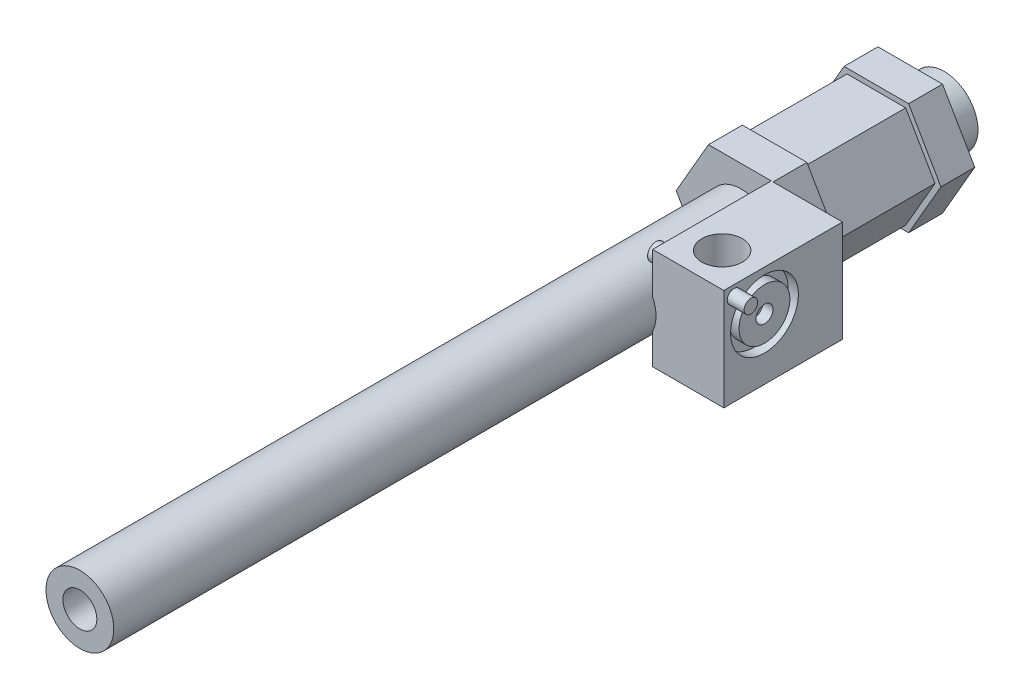
ISO-10303-21;
HEADER;
FILE_DESCRIPTION(('STEP AP214'),'2;1');
FILE_NAME('part.step','',(''),(''),'','','');
FILE_SCHEMA(('AUTOMOTIVE_DESIGN { 1 0 10303 214 1 1 1 1 }'));
ENDSEC;
DATA;
#1=APPLICATION_CONTEXT('core data for automotive mechanical design processes');
#2=APPLICATION_PROTOCOL_DEFINITION('international standard','automotive_design',2000,#1);
#3=PRODUCT_CONTEXT('',#1,'mechanical');
#4=PRODUCT('Part','Part','',(#3));
#5=PRODUCT_RELATED_PRODUCT_CATEGORY('part','',(#4));
#6=PRODUCT_DEFINITION_FORMATION('','',#4);
#7=PRODUCT_DEFINITION_CONTEXT('part definition',#1,'design');
#8=PRODUCT_DEFINITION('design','',#6,#7);
#9=PRODUCT_DEFINITION_SHAPE('','',#8);
#10=(LENGTH_UNIT() NAMED_UNIT(*) SI_UNIT(.MILLI.,.METRE.));
#11=(NAMED_UNIT(*) PLANE_ANGLE_UNIT() SI_UNIT($,.RADIAN.));
#12=(NAMED_UNIT(*) SI_UNIT($,.STERADIAN.) SOLID_ANGLE_UNIT());
#13=UNCERTAINTY_MEASURE_WITH_UNIT(LENGTH_MEASURE(1.E-05),#10,'distance_accuracy_value','');
#14=(GEOMETRIC_REPRESENTATION_CONTEXT(3) GLOBAL_UNCERTAINTY_ASSIGNED_CONTEXT((#13)) GLOBAL_UNIT_ASSIGNED_CONTEXT((#10,
#11,#12)) REPRESENTATION_CONTEXT('',''));
#15=CARTESIAN_POINT('',(0.,0.,0.));
#16=DIRECTION('',(0.,0.,1.));
#17=DIRECTION('',(1.,0.,0.));
#18=AXIS2_PLACEMENT_3D('',#15,#16,#17);
#19=CARTESIAN_POINT('',(0.,0.,60.));
#20=DIRECTION('',(0.,0.,-1.));
#21=DIRECTION('',(-1.,0.,0.));
#22=AXIS2_PLACEMENT_3D('',#19,#20,#21);
#23=PLANE('',#22);
#24=DIRECTION('',(1.,0.,0.));
#25=VECTOR('',#24,1.);
#26=CARTESIAN_POINT('',(9.,-13.5,60.));
#27=LINE('',#26,#25);
#28=CARTESIAN_POINT('',(9.,-13.5,60.));
#29=VERTEX_POINT('',#28);
#30=CARTESIAN_POINT('',(11.2583302491977,-13.5,60.));
#31=VERTEX_POINT('',#30);
#32=EDGE_CURVE('E217',#29,#31,#27,.T.);
#33=ORIENTED_EDGE('',*,*,#32,.F.);
#34=DIRECTION('',(0.,1.,0.));
#35=VECTOR('',#34,1.);
#36=CARTESIAN_POINT('',(9.,0.,60.));
#37=LINE('',#36,#35);
#38=CARTESIAN_POINT('',(9.,-4.35889894354067,60.));
#39=VERTEX_POINT('',#38);
#40=EDGE_CURVE('E418',#29,#39,#37,.T.);
#41=ORIENTED_EDGE('',*,*,#40,.T.);
#42=CARTESIAN_POINT('',(0.,0.,60.));
#43=DIRECTION('',(0.,0.,-1.));
#44=DIRECTION('',(-1.,0.,0.));
#45=AXIS2_PLACEMENT_3D('',#42,#43,#44);
#46=CIRCLE('',#45,10.);
#47=CARTESIAN_POINT('',(9.,4.35889894354067,60.));
#48=VERTEX_POINT('',#47);
#49=EDGE_CURVE('E413',#39,#48,#46,.T.);
#50=ORIENTED_EDGE('',*,*,#49,.T.);
#51=DIRECTION('',(0.,-1.,0.));
#52=VECTOR('',#51,1.);
#53=CARTESIAN_POINT('',(9.,16.5,60.));
#54=LINE('',#53,#52);
#55=CARTESIAN_POINT('',(9.,16.5,60.));
#56=VERTEX_POINT('',#55);
#57=EDGE_CURVE('E244',#56,#48,#54,.T.);
#58=ORIENTED_EDGE('',*,*,#57,.F.);
#59=DIRECTION('',(1.,0.,0.));
#60=VECTOR('',#59,1.);
#61=CARTESIAN_POINT('',(-9.52627944162882,16.5,60.));
#62=LINE('',#61,#60);
#63=CARTESIAN_POINT('',(-9.52627944162882,16.5,60.));
#64=VERTEX_POINT('',#63);
#65=EDGE_CURVE('E289',#64,#56,#62,.T.);
#66=ORIENTED_EDGE('',*,*,#65,.F.);
#67=DIRECTION('',(0.5,0.866025403784438,0.));
#68=VECTOR('',#67,1.);
#69=CARTESIAN_POINT('',(-19.0525588832576,0.,60.));
#70=LINE('',#69,#68);
#71=CARTESIAN_POINT('',(-19.0525588832576,0.,60.));
#72=VERTEX_POINT('',#71);
#73=EDGE_CURVE('E286',#72,#64,#70,.T.);
#74=ORIENTED_EDGE('',*,*,#73,.F.);
#75=DIRECTION('',(-0.5,0.866025403784439,0.));
#76=VECTOR('',#75,1.);
#77=CARTESIAN_POINT('',(-9.52627944162882,-16.5,60.));
#78=LINE('',#77,#76);
#79=CARTESIAN_POINT('',(-9.52627944162882,-16.5,60.));
#80=VERTEX_POINT('',#79);
#81=EDGE_CURVE('E283',#80,#72,#78,.T.);
#82=ORIENTED_EDGE('',*,*,#81,.F.);
#83=DIRECTION('',(-1.,0.,0.));
#84=VECTOR('',#83,1.);
#85=CARTESIAN_POINT('',(9.52627944162882,-16.5,60.));
#86=LINE('',#85,#84);
#87=CARTESIAN_POINT('',(9.52627944162882,-16.5,60.));
#88=VERTEX_POINT('',#87);
#89=EDGE_CURVE('E279',#88,#80,#86,.T.);
#90=ORIENTED_EDGE('',*,*,#89,.F.);
#91=DIRECTION('',(-0.5,-0.866025403784439,0.));
#92=VECTOR('',#91,1.);
#93=CARTESIAN_POINT('',(19.0525588832576,0.,60.));
#94=LINE('',#93,#92);
#95=EDGE_CURVE('E280',#31,#88,#94,.T.);
#96=ORIENTED_EDGE('',*,*,#95,.F.);
#97=EDGE_LOOP('',(#33,#41,#50,#58,#66,#74,#82,#90,#96));
#98=FACE_BOUND('',#97,.T.);
#99=ADVANCED_FACE('F42',(#98),#23,.F.);
#100=CARTESIAN_POINT('',(-8.66025403784439,-15.,60.));
#101=DIRECTION('',(-0.866025403784439,-0.5,0.));
#102=DIRECTION('',(0.5,-0.866025403784439,0.));
#103=AXIS2_PLACEMENT_3D('',#100,#101,#102);
#104=PLANE('',#103);
#105=DIRECTION('',(-0.5,0.866025403784439,0.));
#106=VECTOR('',#105,1.);
#107=CARTESIAN_POINT('',(-8.66025403784439,-15.,50.));
#108=LINE('',#107,#106);
#109=CARTESIAN_POINT('',(-8.66025403784439,-15.,50.));
#110=VERTEX_POINT('',#109);
#111=CARTESIAN_POINT('',(-17.3205080756888,0.,50.));
#112=VERTEX_POINT('',#111);
#113=EDGE_CURVE('E272',#110,#112,#108,.T.);
#114=ORIENTED_EDGE('',*,*,#113,.T.);
#115=DIRECTION('',(0.,0.,-1.));
#116=VECTOR('',#115,1.);
#117=CARTESIAN_POINT('',(-17.3205080756888,0.,60.));
#118=LINE('',#117,#116);
#119=CARTESIAN_POINT('',(-17.3205080756888,0.,20.));
#120=VERTEX_POINT('',#119);
#121=EDGE_CURVE('E391',#112,#120,#118,.T.);
#122=ORIENTED_EDGE('',*,*,#121,.T.);
#123=DIRECTION('',(-0.5,0.866025403784439,0.));
#124=VECTOR('',#123,1.);
#125=CARTESIAN_POINT('',(-8.66025403784439,-15.,20.));
#126=LINE('',#125,#124);
#127=CARTESIAN_POINT('',(-8.66025403784439,-15.,20.));
#128=VERTEX_POINT('',#127);
#129=EDGE_CURVE('E337',#128,#120,#126,.T.);
#130=ORIENTED_EDGE('',*,*,#129,.F.);
#131=DIRECTION('',(0.,0.,-1.));
#132=VECTOR('',#131,1.);
#133=CARTESIAN_POINT('',(-8.66025403784439,-15.,60.));
#134=LINE('',#133,#132);
#135=EDGE_CURVE('E392',#110,#128,#134,.T.);
#136=ORIENTED_EDGE('',*,*,#135,.F.);
#137=EDGE_LOOP('',(#114,#122,#130,#136));
#138=FACE_BOUND('',#137,.T.);
#139=ADVANCED_FACE('F476',(#138),#104,.T.);
#140=CARTESIAN_POINT('',(8.66025403784439,-15.,60.));
#141=DIRECTION('',(0.,-1.,0.));
#142=DIRECTION('',(0.,0.,-1.));
#143=AXIS2_PLACEMENT_3D('',#140,#141,#142);
#144=PLANE('',#143);
#145=DIRECTION('',(-1.,0.,0.));
#146=VECTOR('',#145,1.);
#147=CARTESIAN_POINT('',(8.66025403784439,-15.,50.));
#148=LINE('',#147,#146);
#149=CARTESIAN_POINT('',(8.66025403784439,-15.,50.));
#150=VERTEX_POINT('',#149);
#151=EDGE_CURVE('E65',#150,#110,#148,.T.);
#152=ORIENTED_EDGE('',*,*,#151,.T.);
#153=ORIENTED_EDGE('',*,*,#135,.T.);
#154=DIRECTION('',(-1.,0.,0.));
#155=VECTOR('',#154,1.);
#156=CARTESIAN_POINT('',(8.66025403784439,-15.,20.));
#157=LINE('',#156,#155);
#158=CARTESIAN_POINT('',(8.66025403784439,-15.,20.));
#159=VERTEX_POINT('',#158);
#160=EDGE_CURVE('E334',#159,#128,#157,.T.);
#161=ORIENTED_EDGE('',*,*,#160,.F.);
#162=DIRECTION('',(0.,0.,-1.));
#163=VECTOR('',#162,1.);
#164=CARTESIAN_POINT('',(8.66025403784439,-15.,60.));
#165=LINE('',#164,#163);
#166=EDGE_CURVE('E395',#150,#159,#165,.T.);
#167=ORIENTED_EDGE('',*,*,#166,.F.);
#168=EDGE_LOOP('',(#152,#153,#161,#167));
#169=FACE_BOUND('',#168,.T.);
#170=ADVANCED_FACE('F481',(#169),#144,.T.);
#171=CARTESIAN_POINT('',(17.3205080756888,0.,60.));
#172=DIRECTION('',(0.866025403784439,-0.5,0.));
#173=DIRECTION('',(0.5,0.866025403784439,0.));
#174=AXIS2_PLACEMENT_3D('',#171,#172,#173);
#175=PLANE('',#174);
#176=DIRECTION('',(-0.5,-0.866025403784439,0.));
#177=VECTOR('',#176,1.);
#178=CARTESIAN_POINT('',(17.3205080756888,0.,50.));
#179=LINE('',#178,#177);
#180=CARTESIAN_POINT('',(17.3205080756888,0.,50.));
#181=VERTEX_POINT('',#180);
#182=EDGE_CURVE('E269',#181,#150,#179,.T.);
#183=ORIENTED_EDGE('',*,*,#182,.T.);
#184=ORIENTED_EDGE('',*,*,#166,.T.);
#185=DIRECTION('',(-0.5,-0.866025403784439,0.));
#186=VECTOR('',#185,1.);
#187=CARTESIAN_POINT('',(17.3205080756888,0.,20.));
#188=LINE('',#187,#186);
#189=CARTESIAN_POINT('',(17.3205080756888,0.,20.));
#190=VERTEX_POINT('',#189);
#191=EDGE_CURVE('E331',#190,#159,#188,.T.);
#192=ORIENTED_EDGE('',*,*,#191,.F.);
#193=DIRECTION('',(0.,0.,-1.));
#194=VECTOR('',#193,1.);
#195=CARTESIAN_POINT('',(17.3205080756888,0.,60.));
#196=LINE('',#195,#194);
#197=EDGE_CURVE('E397',#181,#190,#196,.T.);
#198=ORIENTED_EDGE('',*,*,#197,.F.);
#199=EDGE_LOOP('',(#183,#184,#192,#198));
#200=FACE_BOUND('',#199,.T.);
#201=ADVANCED_FACE('F494',(#200),#175,.T.);
#202=CARTESIAN_POINT('',(8.6602540378444,15.,60.));
#203=DIRECTION('',(0.866025403784439,0.5,0.));
#204=DIRECTION('',(-0.5,0.866025403784439,0.));
#205=AXIS2_PLACEMENT_3D('',#202,#203,#204);
#206=PLANE('',#205);
#207=DIRECTION('',(0.5,-0.866025403784439,0.));
#208=VECTOR('',#207,1.);
#209=CARTESIAN_POINT('',(8.6602540378444,15.,50.));
#210=LINE('',#209,#208);
#211=CARTESIAN_POINT('',(8.6602540378444,15.,50.));
#212=VERTEX_POINT('',#211);
#213=EDGE_CURVE('E267',#212,#181,#210,.T.);
#214=ORIENTED_EDGE('',*,*,#213,.T.);
#215=ORIENTED_EDGE('',*,*,#197,.T.);
#216=DIRECTION('',(0.5,-0.866025403784439,0.));
#217=VECTOR('',#216,1.);
#218=CARTESIAN_POINT('',(8.6602540378444,15.,20.));
#219=LINE('',#218,#217);
#220=CARTESIAN_POINT('',(8.6602540378444,15.,20.));
#221=VERTEX_POINT('',#220);
#222=EDGE_CURVE('E328',#221,#190,#219,.T.);
#223=ORIENTED_EDGE('',*,*,#222,.F.);
#224=DIRECTION('',(0.,0.,-1.));
#225=VECTOR('',#224,1.);
#226=CARTESIAN_POINT('',(8.6602540378444,15.,60.));
#227=LINE('',#226,#225);
#228=EDGE_CURVE('E399',#212,#221,#227,.T.);
#229=ORIENTED_EDGE('',*,*,#228,.F.);
#230=EDGE_LOOP('',(#214,#215,#223,#229));
#231=FACE_BOUND('',#230,.T.);
#232=ADVANCED_FACE('F497',(#231),#206,.T.);
#233=CARTESIAN_POINT('',(-8.66025403784437,15.,60.));
#234=DIRECTION('',(0.,1.,0.));
#235=DIRECTION('',(-1.,0.,0.));
#236=AXIS2_PLACEMENT_3D('',#233,#234,#235);
#237=PLANE('',#236);
#238=DIRECTION('',(1.,0.,0.));
#239=VECTOR('',#238,1.);
#240=CARTESIAN_POINT('',(-8.66025403784437,15.,50.));
#241=LINE('',#240,#239);
#242=CARTESIAN_POINT('',(-8.66025403784437,15.,50.));
#243=VERTEX_POINT('',#242);
#244=EDGE_CURVE('E265',#243,#212,#241,.T.);
#245=ORIENTED_EDGE('',*,*,#244,.T.);
#246=ORIENTED_EDGE('',*,*,#228,.T.);
#247=DIRECTION('',(1.,0.,0.));
#248=VECTOR('',#247,1.);
#249=CARTESIAN_POINT('',(-8.66025403784437,15.,20.));
#250=LINE('',#249,#248);
#251=CARTESIAN_POINT('',(-8.66025403784437,15.,20.));
#252=VERTEX_POINT('',#251);
#253=EDGE_CURVE('E325',#252,#221,#250,.T.);
#254=ORIENTED_EDGE('',*,*,#253,.F.);
#255=DIRECTION('',(0.,0.,-1.));
#256=VECTOR('',#255,1.);
#257=CARTESIAN_POINT('',(-8.66025403784437,15.,60.));
#258=LINE('',#257,#256);
#259=EDGE_CURVE('E401',#243,#252,#258,.T.);
#260=ORIENTED_EDGE('',*,*,#259,.F.);
#261=EDGE_LOOP('',(#245,#246,#254,#260));
#262=FACE_BOUND('',#261,.T.);
#263=ADVANCED_FACE('F501',(#262),#237,.T.);
#264=CARTESIAN_POINT('',(-17.3205080756888,0.,60.));
#265=DIRECTION('',(-0.866025403784439,0.5,0.));
#266=DIRECTION('',(-0.5,-0.866025403784439,0.));
#267=AXIS2_PLACEMENT_3D('',#264,#265,#266);
#268=PLANE('',#267);
#269=DIRECTION('',(0.5,0.866025403784439,0.));
#270=VECTOR('',#269,1.);
#271=CARTESIAN_POINT('',(-17.3205080756888,0.,50.));
#272=LINE('',#271,#270);
#273=EDGE_CURVE('E263',#112,#243,#272,.T.);
#274=ORIENTED_EDGE('',*,*,#273,.T.);
#275=ORIENTED_EDGE('',*,*,#259,.T.);
#276=DIRECTION('',(0.5,0.866025403784439,0.));
#277=VECTOR('',#276,1.);
#278=CARTESIAN_POINT('',(-17.3205080756888,0.,20.));
#279=LINE('',#278,#277);
#280=EDGE_CURVE('E313',#120,#252,#279,.T.);
#281=ORIENTED_EDGE('',*,*,#280,.F.);
#282=ORIENTED_EDGE('',*,*,#121,.F.);
#283=EDGE_LOOP('',(#274,#275,#281,#282));
#284=FACE_BOUND('',#283,.T.);
#285=ADVANCED_FACE('F505',(#284),#268,.T.);
#286=CARTESIAN_POINT('',(19.0525588832576,0.,20.));
#287=DIRECTION('',(0.866025403784439,-0.5,0.));
#288=DIRECTION('',(0.5,0.866025403784439,0.));
#289=AXIS2_PLACEMENT_3D('',#286,#287,#288);
#290=PLANE('',#289);
#291=DIRECTION('',(-0.5,-0.866025403784439,0.));
#292=VECTOR('',#291,1.);
#293=CARTESIAN_POINT('',(19.0525588832576,0.,10.));
#294=LINE('',#293,#292);
#295=CARTESIAN_POINT('',(19.0525588832576,0.,10.));
#296=VERTEX_POINT('',#295);
#297=CARTESIAN_POINT('',(9.52627944162882,-16.5,10.));
#298=VERTEX_POINT('',#297);
#299=EDGE_CURVE('E340',#296,#298,#294,.T.);
#300=ORIENTED_EDGE('',*,*,#299,.F.);
#301=DIRECTION('',(0.,0.,-1.));
#302=VECTOR('',#301,1.);
#303=CARTESIAN_POINT('',(19.0525588832576,0.,20.));
#304=LINE('',#303,#302);
#305=CARTESIAN_POINT('',(19.0525588832576,0.,20.));
#306=VERTEX_POINT('',#305);
#307=EDGE_CURVE('E377',#306,#296,#304,.T.);
#308=ORIENTED_EDGE('',*,*,#307,.F.);
#309=DIRECTION('',(-0.5,-0.866025403784439,0.));
#310=VECTOR('',#309,1.);
#311=CARTESIAN_POINT('',(19.0525588832576,0.,20.));
#312=LINE('',#311,#310);
#313=CARTESIAN_POINT('',(9.52627944162882,-16.5,20.));
#314=VERTEX_POINT('',#313);
#315=EDGE_CURVE('E341',#306,#314,#312,.T.);
#316=ORIENTED_EDGE('',*,*,#315,.T.);
#317=DIRECTION('',(0.,0.,-1.));
#318=VECTOR('',#317,1.);
#319=CARTESIAN_POINT('',(9.52627944162882,-16.5,20.));
#320=LINE('',#319,#318);
#321=EDGE_CURVE('E360',#314,#298,#320,.T.);
#322=ORIENTED_EDGE('',*,*,#321,.T.);
#323=EDGE_LOOP('',(#300,#308,#316,#322));
#324=FACE_BOUND('',#323,.T.);
#325=ADVANCED_FACE('F486',(#324),#290,.T.);
#326=CARTESIAN_POINT('',(9.52627944162883,16.5,20.));
#327=DIRECTION('',(0.866025403784439,0.499999999999999,0.));
#328=DIRECTION('',(-0.5,0.866025403784439,0.));
#329=AXIS2_PLACEMENT_3D('',#326,#327,#328);
#330=PLANE('',#329);
#331=DIRECTION('',(0.499999999999999,-0.866025403784439,0.));
#332=VECTOR('',#331,1.);
#333=CARTESIAN_POINT('',(9.52627944162883,16.5,10.));
#334=LINE('',#333,#332);
#335=CARTESIAN_POINT('',(9.52627944162883,16.5,10.));
#336=VERTEX_POINT('',#335);
#337=EDGE_CURVE('E345',#336,#296,#334,.T.);
#338=ORIENTED_EDGE('',*,*,#337,.F.);
#339=DIRECTION('',(0.,0.,-1.));
#340=VECTOR('',#339,1.);
#341=CARTESIAN_POINT('',(9.52627944162883,16.5,20.));
#342=LINE('',#341,#340);
#343=CARTESIAN_POINT('',(9.52627944162883,16.5,20.));
#344=VERTEX_POINT('',#343);
#345=EDGE_CURVE('E380',#344,#336,#342,.T.);
#346=ORIENTED_EDGE('',*,*,#345,.F.);
#347=DIRECTION('',(0.499999999999999,-0.866025403784439,0.));
#348=VECTOR('',#347,1.);
#349=CARTESIAN_POINT('',(9.52627944162883,16.5,20.));
#350=LINE('',#349,#348);
#351=EDGE_CURVE('E357',#344,#306,#350,.T.);
#352=ORIENTED_EDGE('',*,*,#351,.T.);
#353=ORIENTED_EDGE('',*,*,#307,.T.);
#354=EDGE_LOOP('',(#338,#346,#352,#353));
#355=FACE_BOUND('',#354,.T.);
#356=ADVANCED_FACE('F538',(#355),#330,.T.);
#357=CARTESIAN_POINT('',(-9.52627944162882,16.5,20.));
#358=DIRECTION('',(0.,1.,0.));
#359=DIRECTION('',(-1.,0.,0.));
#360=AXIS2_PLACEMENT_3D('',#357,#358,#359);
#361=PLANE('',#360);
#362=DIRECTION('',(1.,0.,0.));
#363=VECTOR('',#362,1.);
#364=CARTESIAN_POINT('',(-9.52627944162882,16.5,10.));
#365=LINE('',#364,#363);
#366=CARTESIAN_POINT('',(-9.52627944162882,16.5,10.));
#367=VERTEX_POINT('',#366);
#368=EDGE_CURVE('E372',#367,#336,#365,.T.);
#369=ORIENTED_EDGE('',*,*,#368,.F.);
#370=DIRECTION('',(0.,0.,-1.));
#371=VECTOR('',#370,1.);
#372=CARTESIAN_POINT('',(-9.52627944162882,16.5,20.));
#373=LINE('',#372,#371);
#374=CARTESIAN_POINT('',(-9.52627944162882,16.5,20.));
#375=VERTEX_POINT('',#374);
#376=EDGE_CURVE('E382',#375,#367,#373,.T.);
#377=ORIENTED_EDGE('',*,*,#376,.F.);
#378=DIRECTION('',(1.,0.,0.));
#379=VECTOR('',#378,1.);
#380=CARTESIAN_POINT('',(-9.52627944162882,16.5,20.));
#381=LINE('',#380,#379);
#382=EDGE_CURVE('E354',#375,#344,#381,.T.);
#383=ORIENTED_EDGE('',*,*,#382,.T.);
#384=ORIENTED_EDGE('',*,*,#345,.T.);
#385=EDGE_LOOP('',(#369,#377,#383,#384));
#386=FACE_BOUND('',#385,.T.);
#387=ADVANCED_FACE('F541',(#386),#361,.T.);
#388=CARTESIAN_POINT('',(-19.0525588832576,0.,20.));
#389=DIRECTION('',(-0.866025403784439,0.5,0.));
#390=DIRECTION('',(-0.5,-0.866025403784439,0.));
#391=AXIS2_PLACEMENT_3D('',#388,#389,#390);
#392=PLANE('',#391);
#393=DIRECTION('',(0.5,0.866025403784438,0.));
#394=VECTOR('',#393,1.);
#395=CARTESIAN_POINT('',(-19.0525588832576,0.,10.));
#396=LINE('',#395,#394);
#397=CARTESIAN_POINT('',(-19.0525588832576,0.,10.));
#398=VERTEX_POINT('',#397);
#399=EDGE_CURVE('E369',#398,#367,#396,.T.);
#400=ORIENTED_EDGE('',*,*,#399,.F.);
#401=DIRECTION('',(0.,0.,-1.));
#402=VECTOR('',#401,1.);
#403=CARTESIAN_POINT('',(-19.0525588832576,0.,20.));
#404=LINE('',#403,#402);
#405=CARTESIAN_POINT('',(-19.0525588832576,0.,20.));
#406=VERTEX_POINT('',#405);
#407=EDGE_CURVE('E384',#406,#398,#404,.T.);
#408=ORIENTED_EDGE('',*,*,#407,.F.);
#409=DIRECTION('',(0.5,0.866025403784438,0.));
#410=VECTOR('',#409,1.);
#411=CARTESIAN_POINT('',(-19.0525588832576,0.,20.));
#412=LINE('',#411,#410);
#413=EDGE_CURVE('E351',#406,#375,#412,.T.);
#414=ORIENTED_EDGE('',*,*,#413,.T.);
#415=ORIENTED_EDGE('',*,*,#376,.T.);
#416=EDGE_LOOP('',(#400,#408,#414,#415));
#417=FACE_BOUND('',#416,.T.);
#418=ADVANCED_FACE('F545',(#417),#392,.T.);
#419=CARTESIAN_POINT('',(-9.52627944162882,-16.5,20.));
#420=DIRECTION('',(-0.866025403784439,-0.5,0.));
#421=DIRECTION('',(0.5,-0.866025403784439,0.));
#422=AXIS2_PLACEMENT_3D('',#419,#420,#421);
#423=PLANE('',#422);
#424=DIRECTION('',(-0.5,0.866025403784439,0.));
#425=VECTOR('',#424,1.);
#426=CARTESIAN_POINT('',(-9.52627944162882,-16.5,10.));
#427=LINE('',#426,#425);
#428=CARTESIAN_POINT('',(-9.52627944162882,-16.5,10.));
#429=VERTEX_POINT('',#428);
#430=EDGE_CURVE('E366',#429,#398,#427,.T.);
#431=ORIENTED_EDGE('',*,*,#430,.F.);
#432=DIRECTION('',(0.,0.,-1.));
#433=VECTOR('',#432,1.);
#434=CARTESIAN_POINT('',(-9.52627944162882,-16.5,20.));
#435=LINE('',#434,#433);
#436=CARTESIAN_POINT('',(-9.52627944162882,-16.5,20.));
#437=VERTEX_POINT('',#436);
#438=EDGE_CURVE('E386',#437,#429,#435,.T.);
#439=ORIENTED_EDGE('',*,*,#438,.F.);
#440=DIRECTION('',(-0.5,0.866025403784439,0.));
#441=VECTOR('',#440,1.);
#442=CARTESIAN_POINT('',(-9.52627944162882,-16.5,20.));
#443=LINE('',#442,#441);
#444=EDGE_CURVE('E348',#437,#406,#443,.T.);
#445=ORIENTED_EDGE('',*,*,#444,.T.);
#446=ORIENTED_EDGE('',*,*,#407,.T.);
#447=EDGE_LOOP('',(#431,#439,#445,#446));
#448=FACE_BOUND('',#447,.T.);
#449=ADVANCED_FACE('F533',(#448),#423,.T.);
#450=CARTESIAN_POINT('',(9.52627944162882,-16.5,20.));
#451=DIRECTION('',(0.,-1.,0.));
#452=DIRECTION('',(0.,0.,-1.));
#453=AXIS2_PLACEMENT_3D('',#450,#451,#452);
#454=PLANE('',#453);
#455=DIRECTION('',(-1.,0.,0.));
#456=VECTOR('',#455,1.);
#457=CARTESIAN_POINT('',(9.52627944162882,-16.5,10.));
#458=LINE('',#457,#456);
#459=EDGE_CURVE('E363',#298,#429,#458,.T.);
#460=ORIENTED_EDGE('',*,*,#459,.F.);
#461=ORIENTED_EDGE('',*,*,#321,.F.);
#462=DIRECTION('',(-1.,0.,0.));
#463=VECTOR('',#462,1.);
#464=CARTESIAN_POINT('',(9.52627944162882,-16.5,20.));
#465=LINE('',#464,#463);
#466=EDGE_CURVE('E344',#314,#437,#465,.T.);
#467=ORIENTED_EDGE('',*,*,#466,.T.);
#468=ORIENTED_EDGE('',*,*,#438,.T.);
#469=EDGE_LOOP('',(#460,#461,#467,#468));
#470=FACE_BOUND('',#469,.T.);
#471=ADVANCED_FACE('F525',(#470),#454,.T.);
#472=CARTESIAN_POINT('',(0.,0.,20.));
#473=DIRECTION('',(0.,0.,-1.));
#474=DIRECTION('',(-1.,0.,0.));
#475=AXIS2_PLACEMENT_3D('',#472,#473,#474);
#476=PLANE('',#475);
#477=ORIENTED_EDGE('',*,*,#129,.T.);
#478=ORIENTED_EDGE('',*,*,#280,.T.);
#479=ORIENTED_EDGE('',*,*,#253,.T.);
#480=ORIENTED_EDGE('',*,*,#222,.T.);
#481=ORIENTED_EDGE('',*,*,#191,.T.);
#482=ORIENTED_EDGE('',*,*,#160,.T.);
#483=EDGE_LOOP('',(#477,#478,#479,#480,#481,#482));
#484=FACE_BOUND('',#483,.T.);
#485=ORIENTED_EDGE('',*,*,#315,.F.);
#486=ORIENTED_EDGE('',*,*,#351,.F.);
#487=ORIENTED_EDGE('',*,*,#382,.F.);
#488=ORIENTED_EDGE('',*,*,#413,.F.);
#489=ORIENTED_EDGE('',*,*,#444,.F.);
#490=ORIENTED_EDGE('',*,*,#466,.F.);
#491=EDGE_LOOP('',(#485,#486,#487,#488,#489,#490));
#492=FACE_BOUND('',#491,.T.);
#493=ADVANCED_FACE('F518',(#484,#492),#476,.F.);
#494=CARTESIAN_POINT('',(0.,0.,0.));
#495=DIRECTION('',(0.,0.,1.));
#496=DIRECTION('',(1.,0.,0.));
#497=AXIS2_PLACEMENT_3D('',#494,#495,#496);
#498=PLANE('',#497);
#499=CARTESIAN_POINT('',(0.,0.,0.));
#500=DIRECTION('',(0.,0.,1.));
#501=DIRECTION('',(1.,0.,0.));
#502=AXIS2_PLACEMENT_3D('',#499,#500,#501);
#503=CIRCLE('',#502,10.);
#504=CARTESIAN_POINT('',(10.,0.,0.));
#505=VERTEX_POINT('',#504);
#506=EDGE_CURVE('E407',#505,#505,#503,.T.);
#507=ORIENTED_EDGE('',*,*,#506,.F.);
#508=EDGE_LOOP('',(#507));
#509=FACE_BOUND('',#508,.T.);
#510=ADVANCED_FACE('F516',(#509),#498,.F.);
#511=CARTESIAN_POINT('',(0.,0.,255.));
#512=DIRECTION('',(0.,0.,-1.));
#513=DIRECTION('',(-1.,0.,0.));
#514=AXIS2_PLACEMENT_3D('',#511,#512,#513);
#515=CYLINDRICAL_SURFACE('',#514,10.);
#516=CARTESIAN_POINT('',(0.,0.,10.));
#517=DIRECTION('',(0.,0.,-1.));
#518=DIRECTION('',(-1.,0.,0.));
#519=AXIS2_PLACEMENT_3D('',#516,#517,#518);
#520=CIRCLE('',#519,10.);
#521=CARTESIAN_POINT('',(-10.,0.,10.));
#522=VERTEX_POINT('',#521);
#523=EDGE_CURVE('E379',#522,#522,#520,.T.);
#524=ORIENTED_EDGE('',*,*,#523,.T.);
#525=EDGE_LOOP('',(#524));
#526=FACE_BOUND('',#525,.T.);
#527=ORIENTED_EDGE('',*,*,#506,.T.);
#528=EDGE_LOOP('',(#527));
#529=FACE_BOUND('',#528,.T.);
#530=ADVANCED_FACE('F44',(#526,#529),#515,.T.);
#531=CARTESIAN_POINT('',(0.,0.,10.));
#532=DIRECTION('',(0.,0.,-1.));
#533=DIRECTION('',(-1.,0.,0.));
#534=AXIS2_PLACEMENT_3D('',#531,#532,#533);
#535=PLANE('',#534);
#536=ORIENTED_EDGE('',*,*,#523,.F.);
#537=EDGE_LOOP('',(#536));
#538=FACE_BOUND('',#537,.T.);
#539=ORIENTED_EDGE('',*,*,#299,.T.);
#540=ORIENTED_EDGE('',*,*,#459,.T.);
#541=ORIENTED_EDGE('',*,*,#430,.T.);
#542=ORIENTED_EDGE('',*,*,#399,.T.);
#543=ORIENTED_EDGE('',*,*,#368,.T.);
#544=ORIENTED_EDGE('',*,*,#337,.T.);
#545=EDGE_LOOP('',(#539,#540,#541,#542,#543,#544));
#546=FACE_BOUND('',#545,.T.);
#547=ADVANCED_FACE('F488',(#538,#546),#535,.T.);
#548=CARTESIAN_POINT('',(19.0525588832576,0.,60.));
#549=DIRECTION('',(0.866025403784439,-0.5,0.));
#550=DIRECTION('',(0.5,0.866025403784439,0.));
#551=AXIS2_PLACEMENT_3D('',#548,#549,#550);
#552=PLANE('',#551);
#553=DIRECTION('',(-0.5,-0.866025403784439,0.));
#554=VECTOR('',#553,1.);
#555=CARTESIAN_POINT('',(19.0525588832576,0.,50.));
#556=LINE('',#555,#554);
#557=CARTESIAN_POINT('',(19.0525588832576,0.,50.));
#558=VERTEX_POINT('',#557);
#559=CARTESIAN_POINT('',(9.52627944162882,-16.5,50.));
#560=VERTEX_POINT('',#559);
#561=EDGE_CURVE('E275',#558,#560,#556,.T.);
#562=ORIENTED_EDGE('',*,*,#561,.F.);
#563=DIRECTION('',(0.,0.,-1.));
#564=VECTOR('',#563,1.);
#565=CARTESIAN_POINT('',(19.0525588832576,0.,60.));
#566=LINE('',#565,#564);
#567=CARTESIAN_POINT('',(19.0525588832576,0.,60.));
#568=VERTEX_POINT('',#567);
#569=EDGE_CURVE('E311',#568,#558,#566,.T.);
#570=ORIENTED_EDGE('',*,*,#569,.F.);
#571=EDGE_CURVE('E276',#568,#31,#94,.T.);
#572=ORIENTED_EDGE('',*,*,#571,.T.);
#573=ORIENTED_EDGE('',*,*,#95,.T.);
#574=DIRECTION('',(0.,0.,-1.));
#575=VECTOR('',#574,1.);
#576=CARTESIAN_POINT('',(9.52627944162882,-16.5,60.));
#577=LINE('',#576,#575);
#578=EDGE_CURVE('E293',#88,#560,#577,.T.);
#579=ORIENTED_EDGE('',*,*,#578,.T.);
#580=EDGE_LOOP('',(#562,#570,#572,#573,#579));
#581=FACE_BOUND('',#580,.T.);
#582=ADVANCED_FACE('F453',(#581),#552,.T.);
#583=CARTESIAN_POINT('',(9.52627944162883,16.5,60.));
#584=DIRECTION('',(0.866025403784439,0.499999999999999,0.));
#585=DIRECTION('',(-0.5,0.866025403784439,0.));
#586=AXIS2_PLACEMENT_3D('',#583,#584,#585);
#587=PLANE('',#586);
#588=DIRECTION('',(0.499999999999999,-0.866025403784439,0.));
#589=VECTOR('',#588,1.);
#590=CARTESIAN_POINT('',(9.52627944162883,16.5,50.));
#591=LINE('',#590,#589);
#592=CARTESIAN_POINT('',(9.52627944162883,16.5,50.));
#593=VERTEX_POINT('',#592);
#594=EDGE_CURVE('E308',#593,#558,#591,.T.);
#595=ORIENTED_EDGE('',*,*,#594,.F.);
#596=DIRECTION('',(0.,0.,-1.));
#597=VECTOR('',#596,1.);
#598=CARTESIAN_POINT('',(9.52627944162883,16.5,60.));
#599=LINE('',#598,#597);
#600=CARTESIAN_POINT('',(9.52627944162883,16.5,60.));
#601=VERTEX_POINT('',#600);
#602=EDGE_CURVE('E314',#601,#593,#599,.T.);
#603=ORIENTED_EDGE('',*,*,#602,.F.);
#604=DIRECTION('',(0.499999999999999,-0.866025403784439,0.));
#605=VECTOR('',#604,1.);
#606=CARTESIAN_POINT('',(9.52627944162883,16.5,60.));
#607=LINE('',#606,#605);
#608=EDGE_CURVE('E213',#601,#568,#607,.T.);
#609=ORIENTED_EDGE('',*,*,#608,.T.);
#610=ORIENTED_EDGE('',*,*,#569,.T.);
#611=EDGE_LOOP('',(#595,#603,#609,#610));
#612=FACE_BOUND('',#611,.T.);
#613=ADVANCED_FACE('F457',(#612),#587,.T.);
#614=CARTESIAN_POINT('',(-9.52627944162882,16.5,60.));
#615=DIRECTION('',(0.,1.,0.));
#616=DIRECTION('',(-1.,0.,0.));
#617=AXIS2_PLACEMENT_3D('',#614,#615,#616);
#618=PLANE('',#617);
#619=CARTESIAN_POINT('',(19.5,16.5,85.));
#620=DIRECTION('',(0.,1.,0.));
#621=DIRECTION('',(0.,0.,1.));
#622=AXIS2_PLACEMENT_3D('',#619,#620,#621);
#623=CIRCLE('',#622,6.);
#624=CARTESIAN_POINT('',(19.5,16.5,91.));
#625=VERTEX_POINT('',#624);
#626=EDGE_CURVE('E237',#625,#625,#623,.T.);
#627=ORIENTED_EDGE('',*,*,#626,.F.);
#628=EDGE_LOOP('',(#627));
#629=FACE_BOUND('',#628,.T.);
#630=DIRECTION('',(1.,0.,0.));
#631=VECTOR('',#630,1.);
#632=CARTESIAN_POINT('',(-9.52627944162882,16.5,50.));
#633=LINE('',#632,#631);
#634=CARTESIAN_POINT('',(-9.52627944162882,16.5,50.));
#635=VERTEX_POINT('',#634);
#636=EDGE_CURVE('E305',#635,#593,#633,.T.);
#637=ORIENTED_EDGE('',*,*,#636,.F.);
#638=DIRECTION('',(0.,0.,-1.));
#639=VECTOR('',#638,1.);
#640=CARTESIAN_POINT('',(-9.52627944162882,16.5,60.));
#641=LINE('',#640,#639);
#642=EDGE_CURVE('E316',#64,#635,#641,.T.);
#643=ORIENTED_EDGE('',*,*,#642,.F.);
#644=ORIENTED_EDGE('',*,*,#65,.T.);
#645=DIRECTION('',(0.,0.,-1.));
#646=VECTOR('',#645,1.);
#647=CARTESIAN_POINT('',(9.,16.5,95.));
#648=LINE('',#647,#646);
#649=CARTESIAN_POINT('',(9.,16.5,95.));
#650=VERTEX_POINT('',#649);
#651=EDGE_CURVE('E57',#650,#56,#648,.T.);
#652=ORIENTED_EDGE('',*,*,#651,.F.);
#653=DIRECTION('',(1.,0.,0.));
#654=VECTOR('',#653,1.);
#655=CARTESIAN_POINT('',(9.,16.5,95.));
#656=LINE('',#655,#654);
#657=CARTESIAN_POINT('',(30.,16.5,95.));
#658=VERTEX_POINT('',#657);
#659=EDGE_CURVE('E224',#650,#658,#656,.T.);
#660=ORIENTED_EDGE('',*,*,#659,.T.);
#661=DIRECTION('',(0.,0.,1.));
#662=VECTOR('',#661,1.);
#663=CARTESIAN_POINT('',(30.,16.5,60.));
#664=LINE('',#663,#662);
#665=CARTESIAN_POINT('',(30.,16.5,60.));
#666=VERTEX_POINT('',#665);
#667=EDGE_CURVE('E220',#666,#658,#664,.T.);
#668=ORIENTED_EDGE('',*,*,#667,.F.);
#669=DIRECTION('',(1.,0.,0.));
#670=VECTOR('',#669,1.);
#671=CARTESIAN_POINT('',(9.,16.5,60.));
#672=LINE('',#671,#670);
#673=EDGE_CURVE('E207',#601,#666,#672,.T.);
#674=ORIENTED_EDGE('',*,*,#673,.F.);
#675=ORIENTED_EDGE('',*,*,#602,.T.);
#676=EDGE_LOOP('',(#637,#643,#644,#652,#660,#668,#674,#675));
#677=FACE_BOUND('',#676,.T.);
#678=ADVANCED_FACE('F222',(#629,#677),#618,.T.);
#679=CARTESIAN_POINT('',(-19.0525588832576,0.,60.));
#680=DIRECTION('',(-0.866025403784439,0.5,0.));
#681=DIRECTION('',(-0.5,-0.866025403784439,0.));
#682=AXIS2_PLACEMENT_3D('',#679,#680,#681);
#683=PLANE('',#682);
#684=DIRECTION('',(0.5,0.866025403784438,0.));
#685=VECTOR('',#684,1.);
#686=CARTESIAN_POINT('',(-19.0525588832576,0.,50.));
#687=LINE('',#686,#685);
#688=CARTESIAN_POINT('',(-19.0525588832576,0.,50.));
#689=VERTEX_POINT('',#688);
#690=EDGE_CURVE('E302',#689,#635,#687,.T.);
#691=ORIENTED_EDGE('',*,*,#690,.F.);
#692=DIRECTION('',(0.,0.,-1.));
#693=VECTOR('',#692,1.);
#694=CARTESIAN_POINT('',(-19.0525588832576,0.,60.));
#695=LINE('',#694,#693);
#696=EDGE_CURVE('E318',#72,#689,#695,.T.);
#697=ORIENTED_EDGE('',*,*,#696,.F.);
#698=ORIENTED_EDGE('',*,*,#73,.T.);
#699=ORIENTED_EDGE('',*,*,#642,.T.);
#700=EDGE_LOOP('',(#691,#697,#698,#699));
#701=FACE_BOUND('',#700,.T.);
#702=ADVANCED_FACE('F442',(#701),#683,.T.);
#703=CARTESIAN_POINT('',(-9.52627944162882,-16.5,60.));
#704=DIRECTION('',(-0.866025403784439,-0.5,0.));
#705=DIRECTION('',(0.5,-0.866025403784439,0.));
#706=AXIS2_PLACEMENT_3D('',#703,#704,#705);
#707=PLANE('',#706);
#708=DIRECTION('',(-0.5,0.866025403784439,0.));
#709=VECTOR('',#708,1.);
#710=CARTESIAN_POINT('',(-9.52627944162882,-16.5,50.));
#711=LINE('',#710,#709);
#712=CARTESIAN_POINT('',(-9.52627944162882,-16.5,50.));
#713=VERTEX_POINT('',#712);
#714=EDGE_CURVE('E299',#713,#689,#711,.T.);
#715=ORIENTED_EDGE('',*,*,#714,.F.);
#716=DIRECTION('',(0.,0.,-1.));
#717=VECTOR('',#716,1.);
#718=CARTESIAN_POINT('',(-9.52627944162882,-16.5,60.));
#719=LINE('',#718,#717);
#720=EDGE_CURVE('E320',#80,#713,#719,.T.);
#721=ORIENTED_EDGE('',*,*,#720,.F.);
#722=ORIENTED_EDGE('',*,*,#81,.T.);
#723=ORIENTED_EDGE('',*,*,#696,.T.);
#724=EDGE_LOOP('',(#715,#721,#722,#723));
#725=FACE_BOUND('',#724,.T.);
#726=ADVANCED_FACE('F445',(#725),#707,.T.);
#727=CARTESIAN_POINT('',(9.52627944162882,-16.5,60.));
#728=DIRECTION('',(0.,-1.,0.));
#729=DIRECTION('',(0.,0.,-1.));
#730=AXIS2_PLACEMENT_3D('',#727,#728,#729);
#731=PLANE('',#730);
#732=DIRECTION('',(-1.,0.,0.));
#733=VECTOR('',#732,1.);
#734=CARTESIAN_POINT('',(9.52627944162882,-16.5,50.));
#735=LINE('',#734,#733);
#736=EDGE_CURVE('E296',#560,#713,#735,.T.);
#737=ORIENTED_EDGE('',*,*,#736,.F.);
#738=ORIENTED_EDGE('',*,*,#578,.F.);
#739=ORIENTED_EDGE('',*,*,#89,.T.);
#740=ORIENTED_EDGE('',*,*,#720,.T.);
#741=EDGE_LOOP('',(#737,#738,#739,#740));
#742=FACE_BOUND('',#741,.T.);
#743=ADVANCED_FACE('F450',(#742),#731,.T.);
#744=CARTESIAN_POINT('',(0.,0.,50.));
#745=DIRECTION('',(0.,0.,-1.));
#746=DIRECTION('',(-1.,0.,0.));
#747=AXIS2_PLACEMENT_3D('',#744,#745,#746);
#748=PLANE('',#747);
#749=ORIENTED_EDGE('',*,*,#273,.F.);
#750=ORIENTED_EDGE('',*,*,#113,.F.);
#751=ORIENTED_EDGE('',*,*,#151,.F.);
#752=ORIENTED_EDGE('',*,*,#182,.F.);
#753=ORIENTED_EDGE('',*,*,#213,.F.);
#754=ORIENTED_EDGE('',*,*,#244,.F.);
#755=EDGE_LOOP('',(#749,#750,#751,#752,#753,#754));
#756=FACE_BOUND('',#755,.T.);
#757=ORIENTED_EDGE('',*,*,#561,.T.);
#758=ORIENTED_EDGE('',*,*,#736,.T.);
#759=ORIENTED_EDGE('',*,*,#714,.T.);
#760=ORIENTED_EDGE('',*,*,#690,.T.);
#761=ORIENTED_EDGE('',*,*,#636,.T.);
#762=ORIENTED_EDGE('',*,*,#594,.T.);
#763=EDGE_LOOP('',(#757,#758,#759,#760,#761,#762));
#764=FACE_BOUND('',#763,.T.);
#765=ADVANCED_FACE('F459',(#756,#764),#748,.T.);
#766=CARTESIAN_POINT('',(0.,0.,5.));
#767=DIRECTION('',(0.,0.,1.));
#768=DIRECTION('',(1.,0.,0.));
#769=AXIS2_PLACEMENT_3D('',#766,#767,#768);
#770=PLANE('',#769);
#771=CARTESIAN_POINT('',(0.,0.,5.));
#772=DIRECTION('',(0.,0.,1.));
#773=DIRECTION('',(1.,0.,0.));
#774=AXIS2_PLACEMENT_3D('',#771,#772,#773);
#775=CIRCLE('',#774,5.);
#776=CARTESIAN_POINT('',(5.,0.,5.));
#777=VERTEX_POINT('',#776);
#778=EDGE_CURVE('E404',#777,#777,#775,.T.);
#779=ORIENTED_EDGE('',*,*,#778,.T.);
#780=EDGE_LOOP('',(#779));
#781=FACE_BOUND('',#780,.T.);
#782=ADVANCED_FACE('F461',(#781),#770,.T.);
#783=CARTESIAN_POINT('',(0.,0.,5.));
#784=DIRECTION('',(0.,0.,1.));
#785=DIRECTION('',(1.,0.,0.));
#786=AXIS2_PLACEMENT_3D('',#783,#784,#785);
#787=CYLINDRICAL_SURFACE('',#786,5.);
#788=ORIENTED_EDGE('',*,*,#778,.F.);
#789=EDGE_LOOP('',(#788));
#790=FACE_BOUND('',#789,.T.);
#791=CARTESIAN_POINT('',(0.,0.,255.));
#792=DIRECTION('',(0.,0.,1.));
#793=DIRECTION('',(1.,0.,0.));
#794=AXIS2_PLACEMENT_3D('',#791,#792,#793);
#795=CIRCLE('',#794,5.);
#796=CARTESIAN_POINT('',(5.,0.,255.));
#797=VERTEX_POINT('',#796);
#798=EDGE_CURVE('E394',#797,#797,#795,.T.);
#799=ORIENTED_EDGE('',*,*,#798,.T.);
#800=EDGE_LOOP('',(#799));
#801=FACE_BOUND('',#800,.T.);
#802=ADVANCED_FACE('F468',(#790,#801),#787,.F.);
#803=CARTESIAN_POINT('',(0.,0.,255.));
#804=DIRECTION('',(0.,0.,1.));
#805=DIRECTION('',(1.,0.,0.));
#806=AXIS2_PLACEMENT_3D('',#803,#804,#805);
#807=PLANE('',#806);
#808=ORIENTED_EDGE('',*,*,#798,.F.);
#809=EDGE_LOOP('',(#808));
#810=FACE_BOUND('',#809,.T.);
#811=CARTESIAN_POINT('',(0.,0.,255.));
#812=DIRECTION('',(0.,0.,1.));
#813=DIRECTION('',(1.,0.,0.));
#814=AXIS2_PLACEMENT_3D('',#811,#812,#813);
#815=CIRCLE('',#814,10.);
#816=CARTESIAN_POINT('',(10.,0.,255.));
#817=VERTEX_POINT('',#816);
#818=EDGE_CURVE('E410',#817,#817,#815,.T.);
#819=ORIENTED_EDGE('',*,*,#818,.T.);
#820=EDGE_LOOP('',(#819));
#821=FACE_BOUND('',#820,.T.);
#822=ADVANCED_FACE('F512',(#810,#821),#807,.T.);
#823=ORIENTED_EDGE('',*,*,#818,.F.);
#824=EDGE_LOOP('',(#823));
#825=FACE_BOUND('',#824,.T.);
#826=CARTESIAN_POINT('',(0.,0.,95.));
#827=DIRECTION('',(0.,0.,-1.));
#828=DIRECTION('',(-1.,0.,0.));
#829=AXIS2_PLACEMENT_3D('',#826,#827,#828);
#830=CIRCLE('',#829,10.);
#831=CARTESIAN_POINT('',(9.,4.35889894354067,95.));
#832=VERTEX_POINT('',#831);
#833=CARTESIAN_POINT('',(9.,-4.35889894354067,95.));
#834=VERTEX_POINT('',#833);
#835=EDGE_CURVE('E50',#832,#834,#830,.T.);
#836=ORIENTED_EDGE('',*,*,#835,.F.);
#837=DIRECTION('',(0.,0.,-1.));
#838=VECTOR('',#837,1.);
#839=CARTESIAN_POINT('',(9.,4.35889894354067,255.));
#840=LINE('',#839,#838);
#841=EDGE_CURVE('E260',#832,#48,#840,.T.);
#842=ORIENTED_EDGE('',*,*,#841,.T.);
#843=ORIENTED_EDGE('',*,*,#49,.F.);
#844=DIRECTION('',(0.,0.,-1.));
#845=VECTOR('',#844,1.);
#846=CARTESIAN_POINT('',(9.,-4.35889894354067,255.));
#847=LINE('',#846,#845);
#848=EDGE_CURVE('E216',#39,#834,#847,.F.);
#849=ORIENTED_EDGE('',*,*,#848,.T.);
#850=EDGE_LOOP('',(#836,#842,#843,#849));
#851=FACE_BOUND('',#850,.T.);
#852=ADVANCED_FACE('F431',(#825,#851),#515,.T.);
#853=CARTESIAN_POINT('',(9.,16.5,60.));
#854=DIRECTION('',(0.,0.,1.));
#855=DIRECTION('',(0.,-1.,0.));
#856=AXIS2_PLACEMENT_3D('',#853,#854,#855);
#857=PLANE('',#856);
#858=ORIENTED_EDGE('',*,*,#571,.F.);
#859=ORIENTED_EDGE('',*,*,#608,.F.);
#860=ORIENTED_EDGE('',*,*,#673,.T.);
#861=DIRECTION('',(0.,1.,0.));
#862=VECTOR('',#861,1.);
#863=CARTESIAN_POINT('',(30.,16.5,60.));
#864=LINE('',#863,#862);
#865=CARTESIAN_POINT('',(30.,-13.5,60.));
#866=VERTEX_POINT('',#865);
#867=EDGE_CURVE('E211',#866,#666,#864,.T.);
#868=ORIENTED_EDGE('',*,*,#867,.F.);
#869=EDGE_CURVE('E255',#31,#866,#27,.T.);
#870=ORIENTED_EDGE('',*,*,#869,.F.);
#871=EDGE_LOOP('',(#858,#859,#860,#868,#870));
#872=FACE_BOUND('',#871,.T.);
#873=ADVANCED_FACE('F209',(#872),#857,.F.);
#874=CARTESIAN_POINT('',(9.,0.,0.));
#875=DIRECTION('',(-1.,0.,0.));
#876=DIRECTION('',(0.,0.,1.));
#877=AXIS2_PLACEMENT_3D('',#874,#875,#876);
#878=PLANE('',#877);
#879=CARTESIAN_POINT('',(9.,11.5,90.));
#880=DIRECTION('',(-1.,0.,0.));
#881=DIRECTION('',(0.,0.,1.));
#882=AXIS2_PLACEMENT_3D('',#879,#880,#881);
#883=CIRCLE('',#882,2.5);
#884=CARTESIAN_POINT('',(9.,11.5,92.5));
#885=VERTEX_POINT('',#884);
#886=EDGE_CURVE('E900',#885,#885,#883,.T.);
#887=ORIENTED_EDGE('',*,*,#886,.F.);
#888=EDGE_LOOP('',(#887));
#889=FACE_BOUND('',#888,.T.);
#890=ORIENTED_EDGE('',*,*,#841,.F.);
#891=DIRECTION('',(0.,1.,0.));
#892=VECTOR('',#891,1.);
#893=CARTESIAN_POINT('',(9.,-13.5,95.));
#894=LINE('',#893,#892);
#895=EDGE_CURVE('E248',#832,#650,#894,.T.);
#896=ORIENTED_EDGE('',*,*,#895,.T.);
#897=ORIENTED_EDGE('',*,*,#651,.T.);
#898=ORIENTED_EDGE('',*,*,#57,.T.);
#899=EDGE_LOOP('',(#890,#896,#897,#898));
#900=FACE_BOUND('',#899,.T.);
#901=ADVANCED_FACE('F707',(#889,#900),#878,.T.);
#902=ORIENTED_EDGE('',*,*,#848,.F.);
#903=ORIENTED_EDGE('',*,*,#40,.F.);
#904=DIRECTION('',(0.,0.,1.));
#905=VECTOR('',#904,1.);
#906=CARTESIAN_POINT('',(9.,-13.5,60.));
#907=LINE('',#906,#905);
#908=CARTESIAN_POINT('',(9.,-13.5,95.));
#909=VERTEX_POINT('',#908);
#910=EDGE_CURVE('E246',#29,#909,#907,.T.);
#911=ORIENTED_EDGE('',*,*,#910,.T.);
#912=EDGE_CURVE('E249',#909,#834,#894,.T.);
#913=ORIENTED_EDGE('',*,*,#912,.T.);
#914=EDGE_LOOP('',(#902,#903,#911,#913));
#915=FACE_BOUND('',#914,.T.);
#916=ADVANCED_FACE('F427',(#915),#878,.T.);
#917=CARTESIAN_POINT('',(9.,-13.5,60.));
#918=DIRECTION('',(0.,1.,0.));
#919=DIRECTION('',(0.,0.,1.));
#920=AXIS2_PLACEMENT_3D('',#917,#918,#919);
#921=PLANE('',#920);
#922=ORIENTED_EDGE('',*,*,#869,.T.);
#923=DIRECTION('',(0.,0.,-1.));
#924=VECTOR('',#923,1.);
#925=CARTESIAN_POINT('',(30.,-13.5,60.));
#926=LINE('',#925,#924);
#927=CARTESIAN_POINT('',(30.,-13.5,95.));
#928=VERTEX_POINT('',#927);
#929=EDGE_CURVE('E233',#928,#866,#926,.T.);
#930=ORIENTED_EDGE('',*,*,#929,.F.);
#931=DIRECTION('',(1.,0.,0.));
#932=VECTOR('',#931,1.);
#933=CARTESIAN_POINT('',(9.,-13.5,95.));
#934=LINE('',#933,#932);
#935=EDGE_CURVE('E253',#909,#928,#934,.T.);
#936=ORIENTED_EDGE('',*,*,#935,.F.);
#937=ORIENTED_EDGE('',*,*,#910,.F.);
#938=ORIENTED_EDGE('',*,*,#32,.T.);
#939=EDGE_LOOP('',(#922,#930,#936,#937,#938));
#940=FACE_BOUND('',#939,.T.);
#941=ADVANCED_FACE('F437',(#940),#921,.F.);
#942=CARTESIAN_POINT('',(9.,-13.5,95.));
#943=DIRECTION('',(0.,0.,-1.));
#944=DIRECTION('',(-1.,0.,0.));
#945=AXIS2_PLACEMENT_3D('',#942,#943,#944);
#946=PLANE('',#945);
#947=ORIENTED_EDGE('',*,*,#895,.F.);
#948=ORIENTED_EDGE('',*,*,#835,.T.);
#949=ORIENTED_EDGE('',*,*,#912,.F.);
#950=ORIENTED_EDGE('',*,*,#935,.T.);
#951=DIRECTION('',(0.,-1.,0.));
#952=VECTOR('',#951,1.);
#953=CARTESIAN_POINT('',(30.,16.5,95.));
#954=LINE('',#953,#952);
#955=EDGE_CURVE('E228',#658,#928,#954,.T.);
#956=ORIENTED_EDGE('',*,*,#955,.F.);
#957=ORIENTED_EDGE('',*,*,#659,.F.);
#958=EDGE_LOOP('',(#947,#948,#949,#950,#956,#957));
#959=FACE_BOUND('',#958,.T.);
#960=ADVANCED_FACE('F424',(#959),#946,.F.);
#961=CARTESIAN_POINT('',(30.,0.,0.));
#962=DIRECTION('',(-1.,0.,0.));
#963=DIRECTION('',(0.,0.,1.));
#964=AXIS2_PLACEMENT_3D('',#961,#962,#963);
#965=PLANE('',#964);
#966=CARTESIAN_POINT('',(30.,13.5,92.));
#967=DIRECTION('',(-1.,0.,0.));
#968=DIRECTION('',(0.,0.,1.));
#969=AXIS2_PLACEMENT_3D('',#966,#967,#968);
#970=CIRCLE('',#969,2.);
#971=CARTESIAN_POINT('',(30.,13.5,94.));
#972=VERTEX_POINT('',#971);
#973=EDGE_CURVE('E12',#972,#972,#970,.F.);
#974=ORIENTED_EDGE('',*,*,#973,.F.);
#975=EDGE_LOOP('',(#974));
#976=FACE_BOUND('',#975,.T.);
#977=CARTESIAN_POINT('',(30.,4.50000000000001,83.));
#978=DIRECTION('',(1.,0.,0.));
#979=DIRECTION('',(0.,0.,-1.));
#980=AXIS2_PLACEMENT_3D('',#977,#978,#979);
#981=CIRCLE('',#980,9.99999999999999);
#982=CARTESIAN_POINT('',(30.,4.50000000000001,73.));
#983=VERTEX_POINT('',#982);
#984=EDGE_CURVE('E897',#983,#983,#981,.T.);
#985=ORIENTED_EDGE('',*,*,#984,.F.);
#986=EDGE_LOOP('',(#985));
#987=FACE_BOUND('',#986,.T.);
#988=ORIENTED_EDGE('',*,*,#867,.T.);
#989=ORIENTED_EDGE('',*,*,#667,.T.);
#990=ORIENTED_EDGE('',*,*,#955,.T.);
#991=ORIENTED_EDGE('',*,*,#929,.T.);
#992=EDGE_LOOP('',(#988,#989,#990,#991));
#993=FACE_BOUND('',#992,.T.);
#994=ADVANCED_FACE('F231',(#976,#987,#993),#965,.F.);
#995=CARTESIAN_POINT('',(19.5,-4.49999999999999,85.));
#996=DIRECTION('',(0.,1.,0.));
#997=DIRECTION('',(0.,0.,1.));
#998=AXIS2_PLACEMENT_3D('',#995,#996,#997);
#999=CYLINDRICAL_SURFACE('',#998,6.);
#1000=CARTESIAN_POINT('',(19.5,-4.49999999999999,85.));
#1001=DIRECTION('',(0.,1.,0.));
#1002=DIRECTION('',(0.,0.,1.));
#1003=AXIS2_PLACEMENT_3D('',#1000,#1001,#1002);
#1004=CIRCLE('',#1003,6.);
#1005=CARTESIAN_POINT('',(19.5,-4.49999999999999,91.));
#1006=VERTEX_POINT('',#1005);
#1007=EDGE_CURVE('E234',#1006,#1006,#1004,.T.);
#1008=ORIENTED_EDGE('',*,*,#1007,.F.);
#1009=EDGE_LOOP('',(#1008));
#1010=FACE_BOUND('',#1009,.T.);
#1011=ORIENTED_EDGE('',*,*,#626,.T.);
#1012=EDGE_LOOP('',(#1011));
#1013=FACE_BOUND('',#1012,.T.);
#1014=ADVANCED_FACE('F751',(#1010,#1013),#999,.F.);
#1015=CARTESIAN_POINT('',(19.5,-4.49999999999999,85.));
#1016=DIRECTION('',(0.,1.,0.));
#1017=DIRECTION('',(0.,0.,1.));
#1018=AXIS2_PLACEMENT_3D('',#1015,#1016,#1017);
#1019=PLANE('',#1018);
#1020=ORIENTED_EDGE('',*,*,#1007,.T.);
#1021=EDGE_LOOP('',(#1020));
#1022=FACE_BOUND('',#1021,.T.);
#1023=ADVANCED_FACE('F755',(#1022),#1019,.T.);
#1024=CARTESIAN_POINT('',(5.,11.5,90.));
#1025=DIRECTION('',(1.,0.,0.));
#1026=DIRECTION('',(0.,0.,-1.));
#1027=AXIS2_PLACEMENT_3D('',#1024,#1025,#1026);
#1028=CYLINDRICAL_SURFACE('',#1027,2.5);
#1029=CARTESIAN_POINT('',(5.,11.5,90.));
#1030=DIRECTION('',(-1.,0.,0.));
#1031=DIRECTION('',(0.,0.,1.));
#1032=AXIS2_PLACEMENT_3D('',#1029,#1030,#1031);
#1033=CIRCLE('',#1032,2.5);
#1034=CARTESIAN_POINT('',(5.,11.5,92.5));
#1035=VERTEX_POINT('',#1034);
#1036=EDGE_CURVE('E905',#1035,#1035,#1033,.T.);
#1037=ORIENTED_EDGE('',*,*,#1036,.F.);
#1038=EDGE_LOOP('',(#1037));
#1039=FACE_BOUND('',#1038,.T.);
#1040=ORIENTED_EDGE('',*,*,#886,.T.);
#1041=EDGE_LOOP('',(#1040));
#1042=FACE_BOUND('',#1041,.T.);
#1043=ADVANCED_FACE('F765',(#1039,#1042),#1028,.T.);
#1044=CARTESIAN_POINT('',(5.,11.5,90.));
#1045=DIRECTION('',(-1.,0.,0.));
#1046=DIRECTION('',(0.,0.,1.));
#1047=AXIS2_PLACEMENT_3D('',#1044,#1045,#1046);
#1048=PLANE('',#1047);
#1049=ORIENTED_EDGE('',*,*,#1036,.T.);
#1050=EDGE_LOOP('',(#1049));
#1051=FACE_BOUND('',#1050,.T.);
#1052=ADVANCED_FACE('F781',(#1051),#1048,.T.);
#1053=CARTESIAN_POINT('',(27.,4.50000000000001,83.));
#1054=DIRECTION('',(1.,0.,0.));
#1055=DIRECTION('',(0.,0.,-1.));
#1056=AXIS2_PLACEMENT_3D('',#1053,#1054,#1055);
#1057=CYLINDRICAL_SURFACE('',#1056,7.5);
#1058=CARTESIAN_POINT('',(27.,4.50000000000001,83.));
#1059=DIRECTION('',(1.,0.,0.));
#1060=DIRECTION('',(0.,0.,-1.));
#1061=AXIS2_PLACEMENT_3D('',#1058,#1059,#1060);
#1062=CIRCLE('',#1061,7.5);
#1063=CARTESIAN_POINT('',(27.,4.50000000000001,75.5));
#1064=VERTEX_POINT('',#1063);
#1065=EDGE_CURVE('E893',#1064,#1064,#1062,.T.);
#1066=ORIENTED_EDGE('',*,*,#1065,.T.);
#1067=EDGE_LOOP('',(#1066));
#1068=FACE_BOUND('',#1067,.T.);
#1069=CARTESIAN_POINT('',(30.,4.50000000000001,83.));
#1070=DIRECTION('',(1.,0.,0.));
#1071=DIRECTION('',(0.,0.,-1.));
#1072=AXIS2_PLACEMENT_3D('',#1069,#1070,#1071);
#1073=CIRCLE('',#1072,7.5);
#1074=CARTESIAN_POINT('',(30.,4.50000000000001,75.5));
#1075=VERTEX_POINT('',#1074);
#1076=EDGE_CURVE('E891',#1075,#1075,#1073,.T.);
#1077=ORIENTED_EDGE('',*,*,#1076,.F.);
#1078=EDGE_LOOP('',(#1077));
#1079=FACE_BOUND('',#1078,.T.);
#1080=ADVANCED_FACE('F791',(#1068,#1079),#1057,.T.);
#1081=CARTESIAN_POINT('',(27.,4.50000000000001,83.));
#1082=DIRECTION('',(1.,0.,0.));
#1083=DIRECTION('',(0.,0.,-1.));
#1084=AXIS2_PLACEMENT_3D('',#1081,#1082,#1083);
#1085=CYLINDRICAL_SURFACE('',#1084,9.99999999999999);
#1086=CARTESIAN_POINT('',(27.,4.50000000000001,83.));
#1087=DIRECTION('',(1.,0.,0.));
#1088=DIRECTION('',(0.,0.,-1.));
#1089=AXIS2_PLACEMENT_3D('',#1086,#1087,#1088);
#1090=CIRCLE('',#1089,9.99999999999999);
#1091=CARTESIAN_POINT('',(27.,4.50000000000001,73.));
#1092=VERTEX_POINT('',#1091);
#1093=EDGE_CURVE('E896',#1092,#1092,#1090,.T.);
#1094=ORIENTED_EDGE('',*,*,#1093,.F.);
#1095=EDGE_LOOP('',(#1094));
#1096=FACE_BOUND('',#1095,.T.);
#1097=ORIENTED_EDGE('',*,*,#984,.T.);
#1098=EDGE_LOOP('',(#1097));
#1099=FACE_BOUND('',#1098,.T.);
#1100=ADVANCED_FACE('F802',(#1096,#1099),#1085,.F.);
#1101=CARTESIAN_POINT('',(27.,0.,0.));
#1102=DIRECTION('',(1.,0.,0.));
#1103=DIRECTION('',(0.,0.,-1.));
#1104=AXIS2_PLACEMENT_3D('',#1101,#1102,#1103);
#1105=PLANE('',#1104);
#1106=ORIENTED_EDGE('',*,*,#1065,.F.);
#1107=EDGE_LOOP('',(#1106));
#1108=FACE_BOUND('',#1107,.T.);
#1109=ORIENTED_EDGE('',*,*,#1093,.T.);
#1110=EDGE_LOOP('',(#1109));
#1111=FACE_BOUND('',#1110,.T.);
#1112=ADVANCED_FACE('F812',(#1108,#1111),#1105,.T.);
#1113=CARTESIAN_POINT('',(30.,4.50000000000001,83.));
#1114=DIRECTION('',(1.,0.,0.));
#1115=DIRECTION('',(0.,0.,-1.));
#1116=AXIS2_PLACEMENT_3D('',#1113,#1114,#1115);
#1117=CIRCLE('',#1116,2.50000000000001);
#1118=CARTESIAN_POINT('',(30.,4.50000000000001,80.5));
#1119=VERTEX_POINT('',#1118);
#1120=EDGE_CURVE('E884',#1119,#1119,#1117,.T.);
#1121=ORIENTED_EDGE('',*,*,#1120,.F.);
#1122=EDGE_LOOP('',(#1121));
#1123=FACE_BOUND('',#1122,.T.);
#1124=ORIENTED_EDGE('',*,*,#1076,.T.);
#1125=EDGE_LOOP('',(#1124));
#1126=FACE_BOUND('',#1125,.T.);
#1127=ADVANCED_FACE('F822',(#1123,#1126),#965,.F.);
#1128=CARTESIAN_POINT('',(27.,4.50000000000001,83.));
#1129=DIRECTION('',(1.,0.,0.));
#1130=DIRECTION('',(0.,0.,-1.));
#1131=AXIS2_PLACEMENT_3D('',#1128,#1129,#1130);
#1132=CYLINDRICAL_SURFACE('',#1131,2.50000000000001);
#1133=CARTESIAN_POINT('',(27.,4.50000000000001,83.));
#1134=DIRECTION('',(1.,0.,0.));
#1135=DIRECTION('',(0.,0.,-1.));
#1136=AXIS2_PLACEMENT_3D('',#1133,#1134,#1135);
#1137=CIRCLE('',#1136,2.50000000000001);
#1138=CARTESIAN_POINT('',(27.,4.50000000000001,80.5));
#1139=VERTEX_POINT('',#1138);
#1140=EDGE_CURVE('E887',#1139,#1139,#1137,.T.);
#1141=ORIENTED_EDGE('',*,*,#1140,.F.);
#1142=EDGE_LOOP('',(#1141));
#1143=FACE_BOUND('',#1142,.T.);
#1144=ORIENTED_EDGE('',*,*,#1120,.T.);
#1145=EDGE_LOOP('',(#1144));
#1146=FACE_BOUND('',#1145,.T.);
#1147=ADVANCED_FACE('F832',(#1143,#1146),#1132,.F.);
#1148=CARTESIAN_POINT('',(27.,0.,0.));
#1149=DIRECTION('',(1.,0.,0.));
#1150=DIRECTION('',(0.,0.,-1.));
#1151=AXIS2_PLACEMENT_3D('',#1148,#1149,#1150);
#1152=PLANE('',#1151);
#1153=ORIENTED_EDGE('',*,*,#1140,.T.);
#1154=EDGE_LOOP('',(#1153));
#1155=FACE_BOUND('',#1154,.T.);
#1156=ADVANCED_FACE('F841',(#1155),#1152,.T.);
#1157=CARTESIAN_POINT('',(35.,13.5,92.));
#1158=DIRECTION('',(-1.,0.,0.));
#1159=DIRECTION('',(0.,0.,1.));
#1160=AXIS2_PLACEMENT_3D('',#1157,#1158,#1159);
#1161=CYLINDRICAL_SURFACE('',#1160,2.);
#1162=CARTESIAN_POINT('',(35.,13.5,92.));
#1163=DIRECTION('',(1.,0.,0.));
#1164=DIRECTION('',(0.,0.,-1.));
#1165=AXIS2_PLACEMENT_3D('',#1162,#1163,#1164);
#1166=CIRCLE('',#1165,2.);
#1167=CARTESIAN_POINT('',(35.,13.5,90.));
#1168=VERTEX_POINT('',#1167);
#1169=EDGE_CURVE('E883',#1168,#1168,#1166,.T.);
#1170=ORIENTED_EDGE('',*,*,#1169,.F.);
#1171=EDGE_LOOP('',(#1170));
#1172=FACE_BOUND('',#1171,.T.);
#1173=ORIENTED_EDGE('',*,*,#973,.T.);
#1174=EDGE_LOOP('',(#1173));
#1175=FACE_BOUND('',#1174,.T.);
#1176=ADVANCED_FACE('F851',(#1172,#1175),#1161,.T.);
#1177=CARTESIAN_POINT('',(35.,13.5,92.));
#1178=DIRECTION('',(1.,0.,0.));
#1179=DIRECTION('',(0.,0.,-1.));
#1180=AXIS2_PLACEMENT_3D('',#1177,#1178,#1179);
#1181=PLANE('',#1180);
#1182=ORIENTED_EDGE('',*,*,#1169,.T.);
#1183=EDGE_LOOP('',(#1182));
#1184=FACE_BOUND('',#1183,.T.);
#1185=ADVANCED_FACE('F867',(#1184),#1181,.T.);
#1186=CLOSED_SHELL('',(#99,#139,#170,#201,#232,#263,#285,#325,#356,#387,#418,#449,#471,#493,
#510,#530,#547,#582,#613,#678,#702,#726,#743,#765,#782,#802,#822,#852,#873,#901,#916,#941,#960,
#994,#1014,#1023,#1043,#1052,#1080,#1100,#1112,#1127,#1147,#1156,#1176,#1185));
#1187=MANIFOLD_SOLID_BREP('B2',#1186);
#1188=ADVANCED_BREP_SHAPE_REPRESENTATION('',(#18,#1187),#14);
#1189=SHAPE_DEFINITION_REPRESENTATION(#9,#1188);
ENDSEC;
END-ISO-10303-21;
